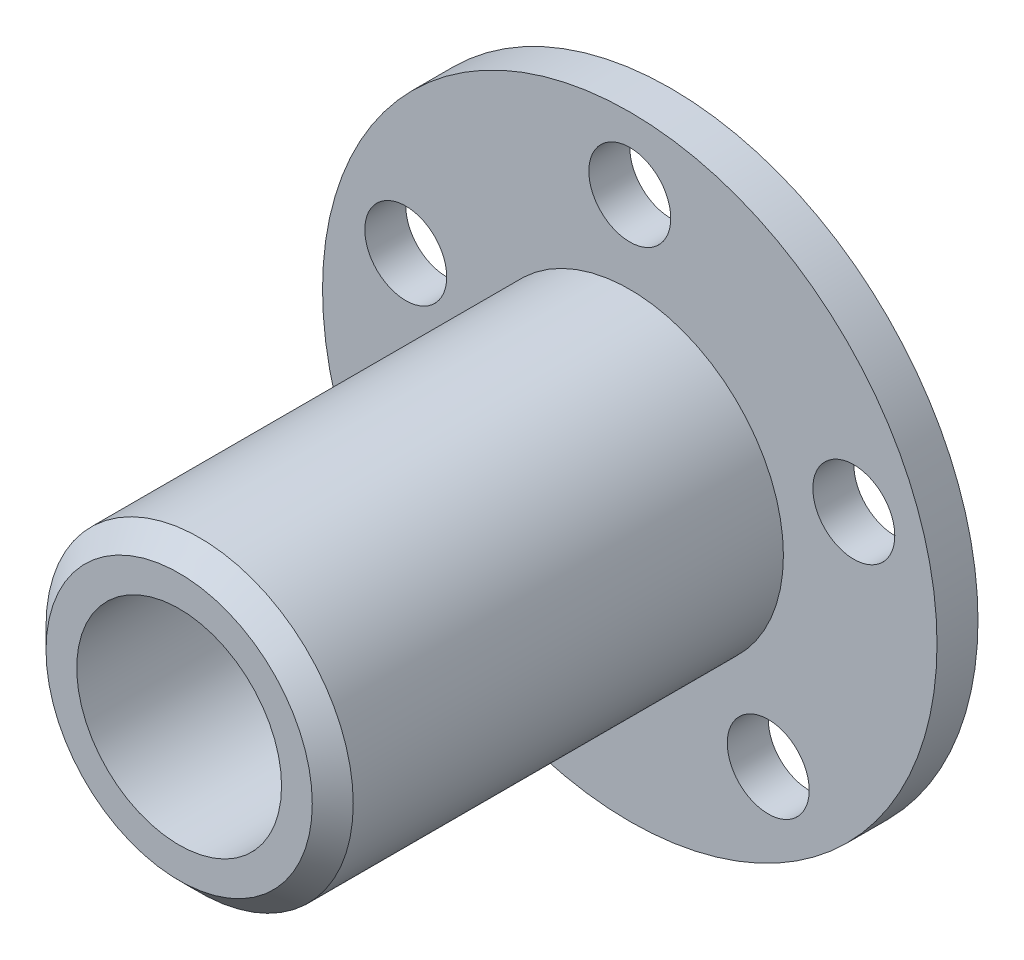
ISO-10303-21;
HEADER;
FILE_DESCRIPTION(('STEP AP214'),'2;1');
FILE_NAME('part.step','',(''),(''),'','','');
FILE_SCHEMA(('AUTOMOTIVE_DESIGN { 1 0 10303 214 1 1 1 1 }'));
ENDSEC;
DATA;
#1=APPLICATION_CONTEXT('core data for automotive mechanical design processes');
#2=APPLICATION_PROTOCOL_DEFINITION('international standard','automotive_design',2000,#1);
#3=PRODUCT_CONTEXT('',#1,'mechanical');
#4=PRODUCT('Part','Part','',(#3));
#5=PRODUCT_RELATED_PRODUCT_CATEGORY('part','',(#4));
#6=PRODUCT_DEFINITION_FORMATION('','',#4);
#7=PRODUCT_DEFINITION_CONTEXT('part definition',#1,'design');
#8=PRODUCT_DEFINITION('design','',#6,#7);
#9=PRODUCT_DEFINITION_SHAPE('','',#8);
#10=(LENGTH_UNIT() NAMED_UNIT(*) SI_UNIT(.MILLI.,.METRE.));
#11=(NAMED_UNIT(*) PLANE_ANGLE_UNIT() SI_UNIT($,.RADIAN.));
#12=(NAMED_UNIT(*) SI_UNIT($,.STERADIAN.) SOLID_ANGLE_UNIT());
#13=UNCERTAINTY_MEASURE_WITH_UNIT(LENGTH_MEASURE(1.E-05),#10,'distance_accuracy_value','');
#14=(GEOMETRIC_REPRESENTATION_CONTEXT(3) GLOBAL_UNCERTAINTY_ASSIGNED_CONTEXT((#13)) GLOBAL_UNIT_ASSIGNED_CONTEXT((#10,
#11,#12)) REPRESENTATION_CONTEXT('',''));
#15=CARTESIAN_POINT('',(0.,0.,0.));
#16=DIRECTION('',(0.,0.,1.));
#17=DIRECTION('',(1.,0.,0.));
#18=AXIS2_PLACEMENT_3D('',#15,#16,#17);
#19=CARTESIAN_POINT('',(0.,0.,2.));
#20=DIRECTION('',(0.,0.,-1.));
#21=DIRECTION('',(-1.,0.,0.));
#22=AXIS2_PLACEMENT_3D('',#19,#20,#21);
#23=CYLINDRICAL_SURFACE('',#22,15.);
#24=CARTESIAN_POINT('',(0.,0.,2.));
#25=DIRECTION('',(0.,0.,1.));
#26=DIRECTION('',(1.,0.,0.));
#27=AXIS2_PLACEMENT_3D('',#24,#25,#26);
#28=CIRCLE('',#27,15.);
#29=CARTESIAN_POINT('',(15.,0.,2.));
#30=VERTEX_POINT('',#29);
#31=EDGE_CURVE('E73',#30,#30,#28,.T.);
#32=ORIENTED_EDGE('',*,*,#31,.F.);
#33=EDGE_LOOP('',(#32));
#34=FACE_BOUND('',#33,.T.);
#35=CARTESIAN_POINT('',(0.,0.,0.));
#36=DIRECTION('',(0.,0.,1.));
#37=DIRECTION('',(1.,0.,0.));
#38=AXIS2_PLACEMENT_3D('',#35,#36,#37);
#39=CIRCLE('',#38,15.);
#40=CARTESIAN_POINT('',(15.,0.,0.));
#41=VERTEX_POINT('',#40);
#42=EDGE_CURVE('E69',#41,#41,#39,.T.);
#43=ORIENTED_EDGE('',*,*,#42,.T.);
#44=EDGE_LOOP('',(#43));
#45=FACE_BOUND('',#44,.T.);
#46=ADVANCED_FACE('F41',(#34,#45),#23,.T.);
#47=CARTESIAN_POINT('',(0.,0.,2.));
#48=DIRECTION('',(0.,0.,1.));
#49=DIRECTION('',(1.,0.,0.));
#50=AXIS2_PLACEMENT_3D('',#47,#48,#49);
#51=PLANE('',#50);
#52=CARTESIAN_POINT('',(0.,11.5,2.));
#53=DIRECTION('',(0.,0.,1.));
#54=DIRECTION('',(1.,0.,0.));
#55=AXIS2_PLACEMENT_3D('',#52,#53,#54);
#56=CIRCLE('',#55,2.);
#57=CARTESIAN_POINT('',(2.,11.5,2.));
#58=VERTEX_POINT('',#57);
#59=EDGE_CURVE('E117',#58,#58,#56,.T.);
#60=ORIENTED_EDGE('',*,*,#59,.F.);
#61=EDGE_LOOP('',(#60));
#62=FACE_BOUND('',#61,.T.);
#63=CARTESIAN_POINT('',(-10.937149937394,3.55369543531158,2.));
#64=DIRECTION('',(0.,0.,1.));
#65=DIRECTION('',(1.,0.,0.));
#66=AXIS2_PLACEMENT_3D('',#63,#64,#65);
#67=CIRCLE('',#66,2.00000000000043);
#68=CARTESIAN_POINT('',(-8.93714993739361,3.55369543531158,2.));
#69=VERTEX_POINT('',#68);
#70=EDGE_CURVE('E113',#69,#69,#67,.T.);
#71=ORIENTED_EDGE('',*,*,#70,.F.);
#72=EDGE_LOOP('',(#71));
#73=FACE_BOUND('',#72,.T.);
#74=CARTESIAN_POINT('',(10.9371499373945,3.55369543531221,2.));
#75=DIRECTION('',(0.,0.,1.));
#76=DIRECTION('',(1.,0.,0.));
#77=AXIS2_PLACEMENT_3D('',#74,#75,#76);
#78=CIRCLE('',#77,2.00000000000016);
#79=CARTESIAN_POINT('',(12.9371499373946,3.55369543531221,2.));
#80=VERTEX_POINT('',#79);
#81=EDGE_CURVE('E105',#80,#80,#78,.T.);
#82=ORIENTED_EDGE('',*,*,#81,.F.);
#83=EDGE_LOOP('',(#82));
#84=FACE_BOUND('',#83,.T.);
#85=CARTESIAN_POINT('',(6.75953040136403,-9.3036954353117,2.));
#86=DIRECTION('',(0.,0.,1.));
#87=DIRECTION('',(1.,0.,0.));
#88=AXIS2_PLACEMENT_3D('',#85,#86,#87);
#89=CIRCLE('',#88,2.00000000000057);
#90=CARTESIAN_POINT('',(8.7595304013646,-9.3036954353117,2.));
#91=VERTEX_POINT('',#90);
#92=EDGE_CURVE('E97',#91,#91,#89,.T.);
#93=ORIENTED_EDGE('',*,*,#92,.F.);
#94=EDGE_LOOP('',(#93));
#95=FACE_BOUND('',#94,.T.);
#96=CARTESIAN_POINT('',(-6.75953040136285,-9.30369543531209,2.));
#97=DIRECTION('',(0.,0.,1.));
#98=DIRECTION('',(1.,0.,0.));
#99=AXIS2_PLACEMENT_3D('',#96,#97,#98);
#100=CIRCLE('',#99,2.00000000000071);
#101=CARTESIAN_POINT('',(-4.75953040136214,-9.30369543531209,2.));
#102=VERTEX_POINT('',#101);
#103=EDGE_CURVE('E89',#102,#102,#100,.T.);
#104=ORIENTED_EDGE('',*,*,#103,.F.);
#105=EDGE_LOOP('',(#104));
#106=FACE_BOUND('',#105,.T.);
#107=CARTESIAN_POINT('',(0.,0.,2.));
#108=DIRECTION('',(0.,0.,1.));
#109=DIRECTION('',(1.,0.,0.));
#110=AXIS2_PLACEMENT_3D('',#107,#108,#109);
#111=CIRCLE('',#110,7.5);
#112=CARTESIAN_POINT('',(7.5,0.,2.));
#113=VERTEX_POINT('',#112);
#114=EDGE_CURVE('E68',#113,#113,#111,.T.);
#115=ORIENTED_EDGE('',*,*,#114,.F.);
#116=EDGE_LOOP('',(#115));
#117=FACE_BOUND('',#116,.T.);
#118=ORIENTED_EDGE('',*,*,#31,.T.);
#119=EDGE_LOOP('',(#118));
#120=FACE_BOUND('',#119,.T.);
#121=ADVANCED_FACE('F137',(#62,#73,#84,#95,#106,#117,#120),#51,.T.);
#122=CARTESIAN_POINT('',(0.,0.,0.));
#123=DIRECTION('',(0.,0.,1.));
#124=DIRECTION('',(1.,0.,0.));
#125=AXIS2_PLACEMENT_3D('',#122,#123,#124);
#126=PLANE('',#125);
#127=CARTESIAN_POINT('',(0.,0.,0.));
#128=DIRECTION('',(0.,0.,1.));
#129=DIRECTION('',(1.,0.,0.));
#130=AXIS2_PLACEMENT_3D('',#127,#128,#129);
#131=CIRCLE('',#130,6.00000000000001);
#132=CARTESIAN_POINT('',(6.00000000000001,0.,0.));
#133=VERTEX_POINT('',#132);
#134=EDGE_CURVE('E62',#133,#133,#131,.T.);
#135=ORIENTED_EDGE('',*,*,#134,.T.);
#136=EDGE_LOOP('',(#135));
#137=FACE_BOUND('',#136,.T.);
#138=CARTESIAN_POINT('',(0.,11.5,0.));
#139=DIRECTION('',(0.,0.,1.));
#140=DIRECTION('',(1.,0.,0.));
#141=AXIS2_PLACEMENT_3D('',#138,#139,#140);
#142=CIRCLE('',#141,2.);
#143=CARTESIAN_POINT('',(2.,11.5,0.));
#144=VERTEX_POINT('',#143);
#145=EDGE_CURVE('E84',#144,#144,#142,.T.);
#146=ORIENTED_EDGE('',*,*,#145,.T.);
#147=EDGE_LOOP('',(#146));
#148=FACE_BOUND('',#147,.T.);
#149=CARTESIAN_POINT('',(-10.937149937394,3.55369543531158,0.));
#150=DIRECTION('',(0.,0.,1.));
#151=DIRECTION('',(1.,0.,0.));
#152=AXIS2_PLACEMENT_3D('',#149,#150,#151);
#153=CIRCLE('',#152,2.00000000000043);
#154=CARTESIAN_POINT('',(-8.93714993739361,3.55369543531158,0.));
#155=VERTEX_POINT('',#154);
#156=EDGE_CURVE('E109',#155,#155,#153,.T.);
#157=ORIENTED_EDGE('',*,*,#156,.T.);
#158=EDGE_LOOP('',(#157));
#159=FACE_BOUND('',#158,.T.);
#160=CARTESIAN_POINT('',(10.9371499373945,3.55369543531221,0.));
#161=DIRECTION('',(0.,0.,1.));
#162=DIRECTION('',(1.,0.,0.));
#163=AXIS2_PLACEMENT_3D('',#160,#161,#162);
#164=CIRCLE('',#163,2.00000000000016);
#165=CARTESIAN_POINT('',(12.9371499373946,3.55369543531221,0.));
#166=VERTEX_POINT('',#165);
#167=EDGE_CURVE('E101',#166,#166,#164,.T.);
#168=ORIENTED_EDGE('',*,*,#167,.T.);
#169=EDGE_LOOP('',(#168));
#170=FACE_BOUND('',#169,.T.);
#171=CARTESIAN_POINT('',(6.75953040136403,-9.3036954353117,0.));
#172=DIRECTION('',(0.,0.,1.));
#173=DIRECTION('',(1.,0.,0.));
#174=AXIS2_PLACEMENT_3D('',#171,#172,#173);
#175=CIRCLE('',#174,2.00000000000057);
#176=CARTESIAN_POINT('',(8.7595304013646,-9.3036954353117,0.));
#177=VERTEX_POINT('',#176);
#178=EDGE_CURVE('E93',#177,#177,#175,.T.);
#179=ORIENTED_EDGE('',*,*,#178,.T.);
#180=EDGE_LOOP('',(#179));
#181=FACE_BOUND('',#180,.T.);
#182=CARTESIAN_POINT('',(-6.75953040136285,-9.30369543531209,0.));
#183=DIRECTION('',(0.,0.,1.));
#184=DIRECTION('',(1.,0.,0.));
#185=AXIS2_PLACEMENT_3D('',#182,#183,#184);
#186=CIRCLE('',#185,2.00000000000071);
#187=CARTESIAN_POINT('',(-4.75953040136214,-9.30369543531209,0.));
#188=VERTEX_POINT('',#187);
#189=EDGE_CURVE('E85',#188,#188,#186,.T.);
#190=ORIENTED_EDGE('',*,*,#189,.T.);
#191=EDGE_LOOP('',(#190));
#192=FACE_BOUND('',#191,.T.);
#193=ORIENTED_EDGE('',*,*,#42,.F.);
#194=EDGE_LOOP('',(#193));
#195=FACE_BOUND('',#194,.T.);
#196=ADVANCED_FACE('F126',(#137,#148,#159,#170,#181,#192,#195),#126,.F.);
#197=CARTESIAN_POINT('',(0.,0.,24.));
#198=DIRECTION('',(0.,0.,-1.));
#199=DIRECTION('',(-1.,0.,0.));
#200=AXIS2_PLACEMENT_3D('',#197,#198,#199);
#201=CYLINDRICAL_SURFACE('',#200,7.5);
#202=CARTESIAN_POINT('',(0.,0.,23.));
#203=DIRECTION('',(0.,0.,1.));
#204=DIRECTION('',(1.,0.,0.));
#205=AXIS2_PLACEMENT_3D('',#202,#203,#204);
#206=CIRCLE('',#205,7.5);
#207=CARTESIAN_POINT('',(7.5,0.,23.));
#208=VERTEX_POINT('',#207);
#209=EDGE_CURVE('E10',#208,#208,#206,.F.);
#210=ORIENTED_EDGE('',*,*,#209,.T.);
#211=EDGE_LOOP('',(#210));
#212=FACE_BOUND('',#211,.T.);
#213=ORIENTED_EDGE('',*,*,#114,.T.);
#214=EDGE_LOOP('',(#213));
#215=FACE_BOUND('',#214,.T.);
#216=ADVANCED_FACE('F159',(#212,#215),#201,.T.);
#217=CARTESIAN_POINT('',(0.,0.,24.));
#218=DIRECTION('',(0.,0.,1.));
#219=DIRECTION('',(1.,0.,0.));
#220=AXIS2_PLACEMENT_3D('',#217,#218,#219);
#221=PLANE('',#220);
#222=CARTESIAN_POINT('',(0.,0.,24.));
#223=DIRECTION('',(0.,0.,1.));
#224=DIRECTION('',(1.,0.,0.));
#225=AXIS2_PLACEMENT_3D('',#222,#223,#224);
#226=CIRCLE('',#225,6.49999999999999);
#227=CARTESIAN_POINT('',(6.49999999999999,0.,24.));
#228=VERTEX_POINT('',#227);
#229=EDGE_CURVE('E50',#228,#228,#226,.T.);
#230=ORIENTED_EDGE('',*,*,#229,.T.);
#231=EDGE_LOOP('',(#230));
#232=FACE_BOUND('',#231,.T.);
#233=CARTESIAN_POINT('',(0.,0.,24.));
#234=DIRECTION('',(0.,0.,1.));
#235=DIRECTION('',(1.,0.,0.));
#236=AXIS2_PLACEMENT_3D('',#233,#234,#235);
#237=CIRCLE('',#236,5.);
#238=CARTESIAN_POINT('',(5.,0.,24.));
#239=VERTEX_POINT('',#238);
#240=EDGE_CURVE('E74',#239,#239,#237,.T.);
#241=ORIENTED_EDGE('',*,*,#240,.F.);
#242=EDGE_LOOP('',(#241));
#243=FACE_BOUND('',#242,.T.);
#244=ADVANCED_FACE('F165',(#232,#243),#221,.T.);
#245=CARTESIAN_POINT('',(0.,0.,0.));
#246=DIRECTION('',(0.,0.,1.));
#247=DIRECTION('',(1.,0.,0.));
#248=AXIS2_PLACEMENT_3D('',#245,#246,#247);
#249=CYLINDRICAL_SURFACE('',#248,5.);
#250=CARTESIAN_POINT('',(0.,0.,1.00000000000001));
#251=DIRECTION('',(0.,0.,1.));
#252=DIRECTION('',(1.,0.,0.));
#253=AXIS2_PLACEMENT_3D('',#250,#251,#252);
#254=CIRCLE('',#253,5.);
#255=CARTESIAN_POINT('',(5.,0.,1.00000000000001));
#256=VERTEX_POINT('',#255);
#257=EDGE_CURVE('E56',#256,#256,#254,.F.);
#258=ORIENTED_EDGE('',*,*,#257,.T.);
#259=EDGE_LOOP('',(#258));
#260=FACE_BOUND('',#259,.T.);
#261=ORIENTED_EDGE('',*,*,#240,.T.);
#262=EDGE_LOOP('',(#261));
#263=FACE_BOUND('',#262,.T.);
#264=ADVANCED_FACE('F180',(#260,#263),#249,.F.);
#265=CARTESIAN_POINT('',(-6.75953040136285,-9.30369543531209,0.));
#266=DIRECTION('',(0.,0.,1.));
#267=DIRECTION('',(1.,0.,0.));
#268=AXIS2_PLACEMENT_3D('',#265,#266,#267);
#269=CYLINDRICAL_SURFACE('',#268,2.00000000000071);
#270=ORIENTED_EDGE('',*,*,#189,.F.);
#271=EDGE_LOOP('',(#270));
#272=FACE_BOUND('',#271,.T.);
#273=ORIENTED_EDGE('',*,*,#103,.T.);
#274=EDGE_LOOP('',(#273));
#275=FACE_BOUND('',#274,.T.);
#276=ADVANCED_FACE('F183',(#272,#275),#269,.F.);
#277=CARTESIAN_POINT('',(6.75953040136403,-9.3036954353117,0.));
#278=DIRECTION('',(0.,0.,1.));
#279=DIRECTION('',(1.,0.,0.));
#280=AXIS2_PLACEMENT_3D('',#277,#278,#279);
#281=CYLINDRICAL_SURFACE('',#280,2.00000000000057);
#282=ORIENTED_EDGE('',*,*,#178,.F.);
#283=EDGE_LOOP('',(#282));
#284=FACE_BOUND('',#283,.T.);
#285=ORIENTED_EDGE('',*,*,#92,.T.);
#286=EDGE_LOOP('',(#285));
#287=FACE_BOUND('',#286,.T.);
#288=ADVANCED_FACE('F194',(#284,#287),#281,.F.);
#289=CARTESIAN_POINT('',(10.9371499373945,3.55369543531221,0.));
#290=DIRECTION('',(0.,0.,1.));
#291=DIRECTION('',(1.,0.,0.));
#292=AXIS2_PLACEMENT_3D('',#289,#290,#291);
#293=CYLINDRICAL_SURFACE('',#292,2.00000000000016);
#294=ORIENTED_EDGE('',*,*,#167,.F.);
#295=EDGE_LOOP('',(#294));
#296=FACE_BOUND('',#295,.T.);
#297=ORIENTED_EDGE('',*,*,#81,.T.);
#298=EDGE_LOOP('',(#297));
#299=FACE_BOUND('',#298,.T.);
#300=ADVANCED_FACE('F198',(#296,#299),#293,.F.);
#301=CARTESIAN_POINT('',(-10.937149937394,3.55369543531158,0.));
#302=DIRECTION('',(0.,0.,1.));
#303=DIRECTION('',(1.,0.,0.));
#304=AXIS2_PLACEMENT_3D('',#301,#302,#303);
#305=CYLINDRICAL_SURFACE('',#304,2.00000000000043);
#306=ORIENTED_EDGE('',*,*,#156,.F.);
#307=EDGE_LOOP('',(#306));
#308=FACE_BOUND('',#307,.T.);
#309=ORIENTED_EDGE('',*,*,#70,.T.);
#310=EDGE_LOOP('',(#309));
#311=FACE_BOUND('',#310,.T.);
#312=ADVANCED_FACE('F133',(#308,#311),#305,.F.);
#313=CARTESIAN_POINT('',(0.,11.5,0.));
#314=DIRECTION('',(0.,0.,1.));
#315=DIRECTION('',(1.,0.,0.));
#316=AXIS2_PLACEMENT_3D('',#313,#314,#315);
#317=CYLINDRICAL_SURFACE('',#316,2.);
#318=ORIENTED_EDGE('',*,*,#145,.F.);
#319=EDGE_LOOP('',(#318));
#320=FACE_BOUND('',#319,.T.);
#321=ORIENTED_EDGE('',*,*,#59,.T.);
#322=EDGE_LOOP('',(#321));
#323=FACE_BOUND('',#322,.T.);
#324=ADVANCED_FACE('F129',(#320,#323),#317,.F.);
#325=CARTESIAN_POINT('',(0.,0.,0.));
#326=DIRECTION('',(0.,0.,-1.));
#327=DIRECTION('',(-1.,0.,0.));
#328=AXIS2_PLACEMENT_3D('',#325,#326,#327);
#329=CONICAL_SURFACE('',#328,6.00000000000001,0.785398163397448);
#330=ORIENTED_EDGE('',*,*,#257,.F.);
#331=EDGE_LOOP('',(#330));
#332=FACE_BOUND('',#331,.T.);
#333=ORIENTED_EDGE('',*,*,#134,.F.);
#334=EDGE_LOOP('',(#333));
#335=FACE_BOUND('',#334,.T.);
#336=ADVANCED_FACE('F132',(#332,#335),#329,.F.);
#337=CARTESIAN_POINT('',(0.,0.,24.));
#338=DIRECTION('',(0.,0.,-1.));
#339=DIRECTION('',(-1.,0.,0.));
#340=AXIS2_PLACEMENT_3D('',#337,#338,#339);
#341=CONICAL_SURFACE('',#340,6.49999999999999,0.785398163397445);
#342=ORIENTED_EDGE('',*,*,#209,.F.);
#343=EDGE_LOOP('',(#342));
#344=FACE_BOUND('',#343,.T.);
#345=ORIENTED_EDGE('',*,*,#229,.F.);
#346=EDGE_LOOP('',(#345));
#347=FACE_BOUND('',#346,.T.);
#348=ADVANCED_FACE('F44',(#344,#347),#341,.T.);
#349=CLOSED_SHELL('',(#46,#121,#196,#216,#244,#264,#276,#288,#300,#312,#324,#336,#348));
#350=MANIFOLD_SOLID_BREP('B2',#349);
#351=ADVANCED_BREP_SHAPE_REPRESENTATION('',(#18,#350),#14);
#352=SHAPE_DEFINITION_REPRESENTATION(#9,#351);
ENDSEC;
END-ISO-10303-21;
